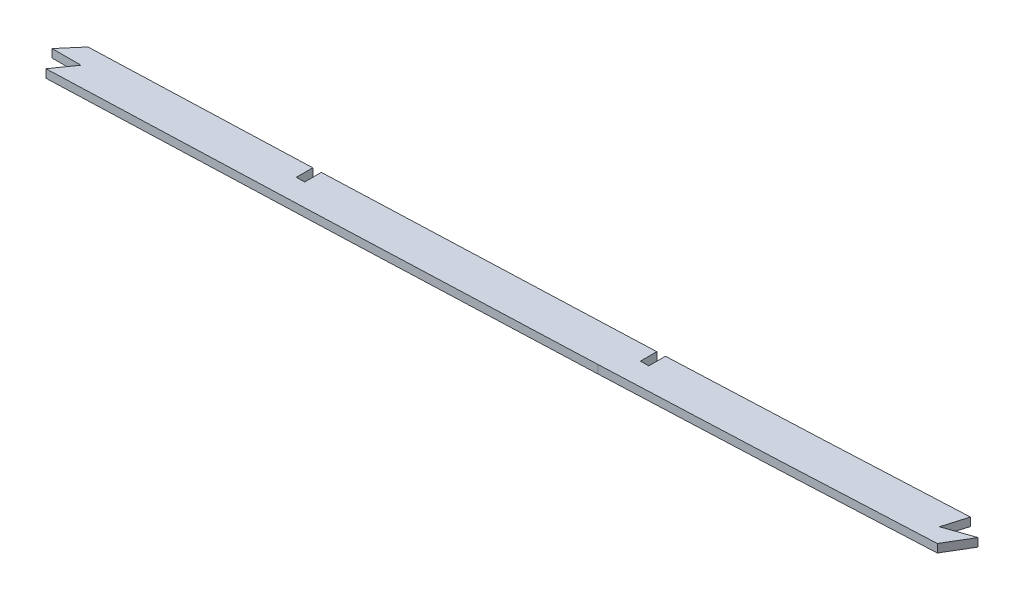
ISO-10303-21;
HEADER;
FILE_DESCRIPTION(('STEP AP214'),'2;1');
FILE_NAME('part.step','',(''),(''),'','','');
FILE_SCHEMA(('AUTOMOTIVE_DESIGN { 1 0 10303 214 1 1 1 1 }'));
ENDSEC;
DATA;
#1=APPLICATION_CONTEXT('core data for automotive mechanical design processes');
#2=APPLICATION_PROTOCOL_DEFINITION('international standard','automotive_design',2000,#1);
#3=PRODUCT_CONTEXT('',#1,'mechanical');
#4=PRODUCT('Part','Part','',(#3));
#5=PRODUCT_RELATED_PRODUCT_CATEGORY('part','',(#4));
#6=PRODUCT_DEFINITION_FORMATION('','',#4);
#7=PRODUCT_DEFINITION_CONTEXT('part definition',#1,'design');
#8=PRODUCT_DEFINITION('design','',#6,#7);
#9=PRODUCT_DEFINITION_SHAPE('','',#8);
#10=(LENGTH_UNIT() NAMED_UNIT(*) SI_UNIT(.MILLI.,.METRE.));
#11=(NAMED_UNIT(*) PLANE_ANGLE_UNIT() SI_UNIT($,.RADIAN.));
#12=(NAMED_UNIT(*) SI_UNIT($,.STERADIAN.) SOLID_ANGLE_UNIT());
#13=UNCERTAINTY_MEASURE_WITH_UNIT(LENGTH_MEASURE(1.E-05),#10,'distance_accuracy_value','');
#14=(GEOMETRIC_REPRESENTATION_CONTEXT(3) GLOBAL_UNCERTAINTY_ASSIGNED_CONTEXT((#13)) GLOBAL_UNIT_ASSIGNED_CONTEXT((#10,
#11,#12)) REPRESENTATION_CONTEXT('',''));
#15=CARTESIAN_POINT('',(0.,0.,0.));
#16=DIRECTION('',(0.,0.,1.));
#17=DIRECTION('',(1.,0.,0.));
#18=AXIS2_PLACEMENT_3D('',#15,#16,#17);
#19=CARTESIAN_POINT('',(2124.37830308858,1.5875,79.252749052653));
#20=CARTESIAN_POINT('',(2148.39751193199,1.5875,78.2710874108631));
#21=CARTESIAN_POINT('',(2196.44142591429,1.5875,76.2202304627624));
#22=CARTESIAN_POINT('',(2256.43632671494,1.5875,73.3193029777612));
#23=CARTESIAN_POINT('',(2304.39682766951,1.5875,70.6868537158113));
#24=CARTESIAN_POINT('',(2340.34200336636,1.5875,68.5440440460852));
#25=CARTESIAN_POINT('',(2376.16909953384,1.5875,66.0999017724206));
#26=CARTESIAN_POINT('',(2423.79225447921,1.5875,62.148433446528));
#27=CARTESIAN_POINT('',(2483.11730251875,1.5875,55.6326510171635));
#28=CARTESIAN_POINT('',(2554.04445691108,1.5875,45.2265308139822));
#29=CARTESIAN_POINT('',(2611.9061277636,1.5875,34.9727556057638));
#30=CARTESIAN_POINT('',(2648.22954061154,1.5875,27.8453657370829));
#31=CARTESIAN_POINT('',(2665.29052708524,1.5875,24.3690973591681));
#32=CARTESIAN_POINT('',(2678.0413738897,1.5875,21.7219433950603));
#33=CARTESIAN_POINT('',(2688.64049273064,1.5875,19.4481755033962));
#34=CARTESIAN_POINT('',(2694.99840626553,1.5875,18.0547973486536));
#35=B_SPLINE_CURVE_WITH_KNOTS('',3,(#19,#20,#21,#22,#23,#24,#25,#26,#27,#28,#29,#30,#31,#32,#33,
#34),.UNSPECIFIED.,.F.,.F.,(4,1,1,1,1,1,1,1,1,1,1,1,1,4),(0.,0.125,0.25,0.3125,0.375,0.4375,0.5,
0.625,0.75,0.875,0.931953524477232,0.943294603731027,0.965976762238616,1.),.UNSPECIFIED.);
#36=DIRECTION('',(0.,-1.,0.));
#37=VECTOR('',#36,1.);
#38=SURFACE_OF_LINEAR_EXTRUSION('',#35,#37);
#39=DIRECTION('',(0.,1.,0.));
#40=VECTOR('',#39,1.);
#41=CARTESIAN_POINT('',(2132.0125,-1.59253086897977,78.9392416373911));
#42=LINE('',#41,#40);
#43=CARTESIAN_POINT('',(2132.01250082935,-1.58999549922679,78.9392214921763));
#44=VERTEX_POINT('',#43);
#45=CARTESIAN_POINT('',(2132.0125,1.5875,78.9392416373911));
#46=VERTEX_POINT('',#45);
#47=EDGE_CURVE('E518',#44,#46,#42,.T.);
#48=ORIENTED_EDGE('',*,*,#47,.F.);
#49=CARTESIAN_POINT('',(2132.01250328962,-1.5875,78.9392415016407));
#50=CARTESIAN_POINT('',(2129.46775073384,-1.5875,79.0442540621415));
#51=CARTESIAN_POINT('',(2126.92301148821,-1.5875,79.1487471830766));
#52=CARTESIAN_POINT('',(2124.37830308858,-1.5875,79.252749052653));
#53=B_SPLINE_CURVE_WITH_KNOTS('',3,(#49,#50,#51,#52),.UNSPECIFIED.,.F.,.F.,(4,4),(0.,
0.013243090229482),.UNSPECIFIED.);
#54=CARTESIAN_POINT('',(2124.37829951673,-1.5875,79.2527491986346));
#55=VERTEX_POINT('',#54);
#56=EDGE_CURVE('E208',#55,#44,#53,.F.);
#57=ORIENTED_EDGE('',*,*,#56,.F.);
#58=DIRECTION('',(0.,-1.,0.));
#59=VECTOR('',#58,1.);
#60=CARTESIAN_POINT('',(2124.37829951673,1.5875,79.2527491986346));
#61=LINE('',#60,#59);
#62=CARTESIAN_POINT('',(2124.37829951673,1.5875,79.2527491986346));
#63=VERTEX_POINT('',#62);
#64=EDGE_CURVE('E346',#63,#55,#61,.T.);
#65=ORIENTED_EDGE('',*,*,#64,.F.);
#66=EDGE_CURVE('E263',#63,#46,#35,.T.);
#67=ORIENTED_EDGE('',*,*,#66,.T.);
#68=EDGE_LOOP('',(#48,#57,#65,#67));
#69=FACE_BOUND('',#68,.T.);
#70=ADVANCED_FACE('F40',(#69),#38,.T.);
#71=DIRECTION('',(0.,1.,0.));
#72=VECTOR('',#71,1.);
#73=CARTESIAN_POINT('',(2247.00294082068,-6.0325,73.7374416090095));
#74=LINE('',#73,#72);
#75=CARTESIAN_POINT('',(2247.00297100051,-1.5875,73.7373388385588));
#76=VERTEX_POINT('',#75);
#77=CARTESIAN_POINT('',(2247.00294082068,1.5875,73.7374416090095));
#78=VERTEX_POINT('',#77);
#79=EDGE_CURVE('E442',#76,#78,#74,.T.);
#80=ORIENTED_EDGE('',*,*,#79,.F.);
#81=CARTESIAN_POINT('',(2247.00301133067,-1.5875,73.7374380659046));
#82=CARTESIAN_POINT('',(2230.15102476226,-1.5875,74.5842451376354));
#83=CARTESIAN_POINT('',(2192.89202498818,-1.5875,76.3543836377749));
#84=CARTESIAN_POINT('',(2155.60411139383,-1.5875,77.9619285937053));
#85=CARTESIAN_POINT('',(2135.18750628123,-1.5875,78.8079495020118));
#86=B_SPLINE_CURVE_WITH_KNOTS('',3,(#81,#82,#83,#84,#85),.UNSPECIFIED.,.F.,.F.,(4,1,4),
(0.0187507346096735,0.106546377678717,0.212795643069043),.UNSPECIFIED.);
#87=CARTESIAN_POINT('',(2135.18750159821,-1.58997749916663,78.8079111511797));
#88=VERTEX_POINT('',#87);
#89=EDGE_CURVE('E215',#88,#76,#86,.F.);
#90=ORIENTED_EDGE('',*,*,#89,.F.);
#91=DIRECTION('',(0.,1.,0.));
#92=VECTOR('',#91,1.);
#93=CARTESIAN_POINT('',(2135.18750000957,-1.59253086897977,78.8079497618963));
#94=LINE('',#93,#92);
#95=CARTESIAN_POINT('',(2135.18750000957,1.5875,78.8079497618963));
#96=VERTEX_POINT('',#95);
#97=EDGE_CURVE('E494',#88,#96,#94,.T.);
#98=ORIENTED_EDGE('',*,*,#97,.T.);
#99=EDGE_CURVE('E200',#96,#78,#35,.T.);
#100=ORIENTED_EDGE('',*,*,#99,.T.);
#101=EDGE_LOOP('',(#80,#90,#98,#100));
#102=FACE_BOUND('',#101,.T.);
#103=ADVANCED_FACE('F493',(#102),#38,.T.);
#104=CARTESIAN_POINT('',(616.337750913255,1.5875,99.0566103609531));
#105=CARTESIAN_POINT('',(647.76049660052,1.5875,99.0799542657679));
#106=CARTESIAN_POINT('',(694.87068034325,1.5875,98.960929783245));
#107=CARTESIAN_POINT('',(757.779786958647,1.5875,98.8040630386954));
#108=CARTESIAN_POINT('',(820.69045818609,1.5875,98.7653484328497));
#109=CARTESIAN_POINT('',(899.289299877085,1.5875,98.7967965825531));
#110=CARTESIAN_POINT('',(993.586772551322,1.5875,98.8129149281116));
#111=CARTESIAN_POINT('',(1087.93191592796,1.5875,98.7323574871025));
#112=CARTESIAN_POINT('',(1182.33953079348,1.5875,99.1244994990799));
#113=CARTESIAN_POINT('',(1276.65398068122,1.5875,99.8147611994573));
#114=CARTESIAN_POINT('',(1370.85083148495,1.5875,100.131815232071));
#115=CARTESIAN_POINT('',(1464.98207813977,1.5875,99.4108190462021));
#116=CARTESIAN_POINT('',(1590.54945268054,1.5875,97.1511702631117));
#117=CARTESIAN_POINT('',(1747.54008126415,1.5875,92.7833872927443));
#118=CARTESIAN_POINT('',(1904.58058478476,1.5875,87.4795525069474));
#119=CARTESIAN_POINT('',(2030.20455421821,1.5875,82.9558758992198));
#120=CARTESIAN_POINT('',(2092.98705848864,1.5875,80.5357121207426));
#121=CARTESIAN_POINT('',(2124.37829951673,1.5875,79.2527491986346));
#122=B_SPLINE_CURVE_WITH_KNOTS('',3,(#104,#105,#106,#107,#108,#109,#110,#111,#112,#113,#114,
#115,#116,#117,#118,#119,#120,#121),.UNSPECIFIED.,.F.,.F.,(4,1,1,1,1,1,1,1,1,1,1,1,1,1,1,4),(0.,
0.0625,0.09375,0.125,0.1875,0.25,0.3125,0.375,0.4375,0.5,0.5625,0.625,0.75,0.875,0.9375,1.),.UNSPECIFIED.);
#123=DIRECTION('',(0.,-1.,0.));
#124=VECTOR('',#123,1.);
#125=SURFACE_OF_LINEAR_EXTRUSION('',#122,#124);
#126=DIRECTION('',(0.,1.,0.));
#127=VECTOR('',#126,1.);
#128=CARTESIAN_POINT('',(1921.82414159405,-6.0325,86.8230267836531));
#129=LINE('',#128,#127);
#130=CARTESIAN_POINT('',(1921.82416586264,-1.5875,86.822998441138));
#131=VERTEX_POINT('',#130);
#132=CARTESIAN_POINT('',(1921.82414159405,1.5875,86.8230267836531));
#133=VERTEX_POINT('',#132);
#134=EDGE_CURVE('E418',#131,#133,#129,.T.);
#135=ORIENTED_EDGE('',*,*,#134,.T.);
#136=CARTESIAN_POINT('',(2005.01249999027,1.5875,83.84691539418));
#137=VERTEX_POINT('',#136);
#138=EDGE_CURVE('E355',#133,#137,#122,.T.);
#139=ORIENTED_EDGE('',*,*,#138,.T.);
#140=DIRECTION('',(0.,1.,0.));
#141=VECTOR('',#140,1.);
#142=CARTESIAN_POINT('',(2005.01249999027,-1.59253086897977,83.84691539418));
#143=LINE('',#142,#141);
#144=CARTESIAN_POINT('',(2005.01249998173,-1.58970324848349,83.8465741901181));
#145=VERTEX_POINT('',#144);
#146=EDGE_CURVE('E234',#145,#137,#143,.T.);
#147=ORIENTED_EDGE('',*,*,#146,.F.);
#148=CARTESIAN_POINT('',(2005.01252218668,-1.5875,83.846914580959));
#149=CARTESIAN_POINT('',(1982.00576485537,-1.5875,84.6898247845221));
#150=CARTESIAN_POINT('',(1954.27553891633,-1.5875,85.6828548780801));
#151=CARTESIAN_POINT('',(1926.54476508251,-1.5875,86.657654555315));
#152=CARTESIAN_POINT('',(1921.82419205508,-1.5875,86.8230250159094));
#153=B_SPLINE_CURVE_WITH_KNOTS('',3,(#148,#149,#150,#151,#152),.UNSPECIFIED.,.F.,.F.,(4,1,4),
(0.865606010358815,0.911396672514716,0.9207906621559),.UNSPECIFIED.);
#154=EDGE_CURVE('E197',#131,#145,#153,.F.);
#155=ORIENTED_EDGE('',*,*,#154,.F.);
#156=EDGE_LOOP('',(#135,#139,#147,#155));
#157=FACE_BOUND('',#156,.T.);
#158=ADVANCED_FACE('F517',(#157),#125,.T.);
#159=CARTESIAN_POINT('',(616.326429146063,1.5875,114.296606155493));
#160=CARTESIAN_POINT('',(632.046217380175,1.5875,114.30828435968));
#161=CARTESIAN_POINT('',(647.765968153244,1.5875,114.29677439422));
#162=CARTESIAN_POINT('',(679.205420392794,1.5875,114.24323397025));
#163=CARTESIAN_POINT('',(694.925123066751,1.5875,114.201950932506));
#164=CARTESIAN_POINT('',(726.364532124698,1.5875,114.121681346548));
#165=CARTESIAN_POINT('',(742.084243399862,1.5875,114.083543006226));
#166=CARTESIAN_POINT('',(773.523671882744,1.5875,114.034083388907));
#167=CARTESIAN_POINT('',(789.243390213417,1.5875,114.023396075664));
#168=CARTESIAN_POINT('',(820.682831324826,1.5875,114.017303041489));
#169=CARTESIAN_POINT('',(836.402553623007,1.5875,114.020240225192));
#170=CARTESIAN_POINT('',(867.841997842806,1.5875,114.024821457385));
#171=CARTESIAN_POINT('',(883.561720421664,1.5875,114.028722489467));
#172=CARTESIAN_POINT('',(915.001165910892,1.5875,114.037662965197));
#173=CARTESIAN_POINT('',(930.720888644625,1.5875,114.042095840025));
#174=CARTESIAN_POINT('',(962.160332217753,1.5875,114.044456392842));
#175=CARTESIAN_POINT('',(977.880053630737,1.5875,114.042025852399));
#176=CARTESIAN_POINT('',(1025.03924062521,1.5875,114.02635266127));
#177=CARTESIAN_POINT('',(1056.47872633141,1.5875,114.001081239981));
#178=CARTESIAN_POINT('',(1103.63774370583,1.5875,114.076141518065));
#179=CARTESIAN_POINT('',(1119.35738201238,1.5875,114.119430036675));
#180=CARTESIAN_POINT('',(1150.79658971577,1.5875,114.242868384306));
#181=CARTESIAN_POINT('',(1166.51615941665,1.5875,114.322855573181));
#182=CARTESIAN_POINT('',(1213.67480633689,1.5875,114.596079866728));
#183=CARTESIAN_POINT('',(1245.11381381393,1.5875,114.824335417931));
#184=CARTESIAN_POINT('',(1307.99206873737,1.5875,115.160349224997));
#185=CARTESIAN_POINT('',(1339.43132783757,1.5875,115.262775920084));
#186=CARTESIAN_POINT('',(1386.59071758969,1.5875,115.166774968219));
#187=CARTESIAN_POINT('',(1402.31059775436,1.5875,115.09313610926));
#188=CARTESIAN_POINT('',(1433.75053971329,1.5875,114.855373393272));
#189=CARTESIAN_POINT('',(1449.46971812607,1.5875,114.691491377402));
#190=CARTESIAN_POINT('',(1480.90524720166,1.5875,114.282993412757));
#191=CARTESIAN_POINT('',(1496.62184273389,1.5875,114.038617844409));
#192=CARTESIAN_POINT('',(1528.05323424889,1.5875,113.488096449305));
#193=CARTESIAN_POINT('',(1543.76803918056,1.5875,113.182257797232));
#194=CARTESIAN_POINT('',(1590.91012672281,1.5875,112.184857954141));
#195=CARTESIAN_POINT('',(1622.33508716355,1.5875,111.413587350345));
#196=CARTESIAN_POINT('',(1685.18062244756,1.5875,109.720508746898));
#197=CARTESIAN_POINT('',(1716.60120600918,1.5875,108.799000007991));
#198=CARTESIAN_POINT('',(1779.43954296825,1.5875,106.858836007746));
#199=CARTESIAN_POINT('',(1810.85730451947,1.5875,105.840460627799));
#200=CARTESIAN_POINT('',(1873.69102784609,1.5875,103.741931839349));
#201=CARTESIAN_POINT('',(1905.10699770462,1.5875,102.662055887814));
#202=CARTESIAN_POINT('',(1967.93740090808,1.5875,100.449562537391));
#203=CARTESIAN_POINT('',(1999.35184226252,1.5875,99.3172200683351));
#204=CARTESIAN_POINT('',(2062.17844269824,1.5875,96.9741951872324));
#205=CARTESIAN_POINT('',(2093.59060920955,1.5875,95.7637678134024));
#206=CARTESIAN_POINT('',(2125.00064017427,1.5875,94.4800369448474));
#207=B_SPLINE_CURVE_WITH_KNOTS('',3,(#159,#160,#161,#162,#163,#164,#165,#166,#167,#168,#169,
#170,#171,#172,#173,#174,#175,#176,#177,#178,#179,#180,#181,#182,#183,#184,#185,#186,#187,#188,
#189,#190,#191,#192,#193,#194,#195,#196,#197,#198,#199,#200,#201,#202,#203,#204,#205,#206),
.UNSPECIFIED.,.F.,.F.,(4,2,2,2,2,2,2,2,2,2,2,2,2,2,2,2,2,2,2,2,2,2,2,4),(0.,0.0312499999999999,
0.0624999999999998,0.0937499999999997,0.125,0.156249999999999,0.187499999999999,
0.218749999999999,0.249999999999999,0.312499999999999,0.343749999999999,0.374999999999999,
0.437499999999998,0.499999999999998,0.531249999999998,0.562499999999998,0.593749999999999,
0.624999999999999,0.687499999999999,0.749999999999999,0.812499999999999,0.875,0.9375,1.),.UNSPECIFIED.);
#208=DIRECTION('',(0.,-1.,0.));
#209=VECTOR('',#208,1.);
#210=SURFACE_OF_LINEAR_EXTRUSION('',#207,#209);
#211=CARTESIAN_POINT('',(2125.00064017427,1.5875,94.4800369448474));
#212=CARTESIAN_POINT('',(2093.59060920955,1.5875,95.7637678134024));
#213=CARTESIAN_POINT('',(2062.17844269824,1.5875,96.9741951872324));
#214=CARTESIAN_POINT('',(1999.35184226252,1.5875,99.3172200683351));
#215=CARTESIAN_POINT('',(1967.93740090808,1.5875,100.449562537391));
#216=CARTESIAN_POINT('',(1931.3515538202,1.5875,101.737886967515));
#217=CARTESIAN_POINT('',(1926.18088752193,1.5875,101.919250338178));
#218=CARTESIAN_POINT('',(1921.01019986067,1.5875,102.099880415705));
#219=B_SPLINE_CURVE_WITH_KNOTS('',3,(#211,#212,#213,#214,#215,#216,#217,#218),.UNSPECIFIED.,.F.,
.F.,(4,2,2,4),(0.864713090274523,0.927213090274523,0.989713090274523,1.),.UNSPECIFIED.);
#220=CARTESIAN_POINT('',(1921.01019968797,1.5875,102.099880421738));
#221=VERTEX_POINT('',#220);
#222=CARTESIAN_POINT('',(2125.00064017427,1.5875,94.4800369448474));
#223=VERTEX_POINT('',#222);
#224=EDGE_CURVE('E185',#221,#223,#219,.F.);
#225=ORIENTED_EDGE('',*,*,#224,.F.);
#226=DIRECTION('',(0.,1.,0.));
#227=VECTOR('',#226,1.);
#228=CARTESIAN_POINT('',(1921.01019968797,-6.0325,102.099880421738));
#229=LINE('',#228,#227);
#230=CARTESIAN_POINT('',(1921.01019968797,-1.5875,102.099880421738));
#231=VERTEX_POINT('',#230);
#232=EDGE_CURVE('E169',#231,#221,#229,.T.);
#233=ORIENTED_EDGE('',*,*,#232,.F.);
#234=CARTESIAN_POINT('',(1921.01019985471,-1.5875,102.099880415913));
#235=CARTESIAN_POINT('',(1926.18088751795,-1.5875,101.919250338317));
#236=CARTESIAN_POINT('',(1931.35155381821,-1.5875,101.737886967585));
#237=CARTESIAN_POINT('',(1967.93740090808,-1.5875,100.449562537391));
#238=CARTESIAN_POINT('',(1999.35184226252,-1.5875,99.3172200683351));
#239=CARTESIAN_POINT('',(2062.17844269824,-1.5875,96.9741951872324));
#240=CARTESIAN_POINT('',(2093.59060920955,-1.5875,95.7637678134024));
#241=CARTESIAN_POINT('',(2125.00064017427,-1.5875,94.4800369448474));
#242=B_SPLINE_CURVE_WITH_KNOTS('',3,(#234,#235,#236,#237,#238,#239,#240,#241),.UNSPECIFIED.,.F.,
.F.,(4,2,2,4),(0.86471309027057,0.875,0.9375,1.),.UNSPECIFIED.);
#243=CARTESIAN_POINT('',(2125.00064017427,-1.5875,94.4800369448474));
#244=VERTEX_POINT('',#243);
#245=EDGE_CURVE('E228',#231,#244,#242,.T.);
#246=ORIENTED_EDGE('',*,*,#245,.T.);
#247=DIRECTION('',(0.,-1.,0.));
#248=VECTOR('',#247,1.);
#249=CARTESIAN_POINT('',(2125.00064017427,1.5875,94.4800369448474));
#250=LINE('',#249,#248);
#251=EDGE_CURVE('E193',#223,#244,#250,.T.);
#252=ORIENTED_EDGE('',*,*,#251,.F.);
#253=EDGE_LOOP('',(#225,#233,#246,#252));
#254=FACE_BOUND('',#253,.T.);
#255=ADVANCED_FACE('F42',(#254),#210,.F.);
#256=CARTESIAN_POINT('',(2125.00064017427,1.5875,94.4800369448474));
#257=CARTESIAN_POINT('',(2149.04351205278,1.5875,93.497408198186));
#258=CARTESIAN_POINT('',(2173.08465693507,1.5875,92.4714303186568));
#259=CARTESIAN_POINT('',(2221.16051111618,1.5875,90.2825451342161));
#260=CARTESIAN_POINT('',(2245.19553408109,1.5875,89.1196551679897));
#261=CARTESIAN_POINT('',(2281.23975724731,1.5875,87.2213575710183));
#262=CARTESIAN_POINT('',(2293.25302693238,1.5875,86.5622387735997));
#263=CARTESIAN_POINT('',(2317.27629287288,1.5875,85.1853725215189));
#264=CARTESIAN_POINT('',(2329.28667496271,1.5875,84.4695877060572));
#265=CARTESIAN_POINT('',(2353.30043194924,1.5875,82.9360976908141));
#266=CARTESIAN_POINT('',(2365.30329886088,1.5875,82.1167454790412));
#267=CARTESIAN_POINT('',(2389.29570022096,1.5875,80.3032013832875));
#268=CARTESIAN_POINT('',(2401.28513168761,1.5875,79.3076590137664));
#269=CARTESIAN_POINT('',(2425.248015539,1.5875,77.1070272915958));
#270=CARTESIAN_POINT('',(2437.21939504412,1.5875,75.9021262287262));
#271=CARTESIAN_POINT('',(2461.1350429249,1.5875,73.2728607205226));
#272=CARTESIAN_POINT('',(2473.08021873022,1.5875,71.848649743833));
#273=CARTESIAN_POINT('',(2496.94588972892,1.5875,68.7864051538839));
#274=CARTESIAN_POINT('',(2508.86721006671,1.5875,67.1484398221377));
#275=CARTESIAN_POINT('',(2532.67675150176,1.5875,63.6755945009625));
#276=CARTESIAN_POINT('',(2544.56619473404,1.5875,61.8407677680709));
#277=CARTESIAN_POINT('',(2568.31735906903,1.5875,57.9931353056948));
#278=CARTESIAN_POINT('',(2580.17961126629,1.5875,55.980432346589));
#279=CARTESIAN_POINT('',(2603.8765766664,1.5875,51.794563265322));
#280=CARTESIAN_POINT('',(2615.71090980775,1.5875,49.6216949956207));
#281=CARTESIAN_POINT('',(2639.35036015543,1.5875,45.1250865007013));
#282=CARTESIAN_POINT('',(2651.15621950326,1.5875,42.8015133301686));
#283=CARTESIAN_POINT('',(2674.73471693345,1.5875,37.9973454558139));
#284=CARTESIAN_POINT('',(2686.50776170266,1.5875,35.5172707099935));
#285=CARTESIAN_POINT('',(2698.26092171884,1.5875,32.9414891543206));
#286=B_SPLINE_CURVE_WITH_KNOTS('',3,(#256,#257,#258,#259,#260,#261,#262,#263,#264,#265,#266,
#267,#268,#269,#270,#271,#272,#273,#274,#275,#276,#277,#278,#279,#280,#281,#282,#283,#284,#285),
.UNSPECIFIED.,.F.,.F.,(4,2,2,2,2,2,2,2,2,2,2,2,2,2,4),(0.,0.125,0.25,0.3125,0.375,0.4375,0.5,
0.5625,0.625,0.6875,0.75,0.8125,0.875,0.9375,1.),.UNSPECIFIED.);
#287=DIRECTION('',(0.,-1.,0.));
#288=VECTOR('',#287,1.);
#289=SURFACE_OF_LINEAR_EXTRUSION('',#286,#288);
#290=CARTESIAN_POINT('',(2125.00064017427,-1.5875,94.4800369448474));
#291=CARTESIAN_POINT('',(2149.04351205278,-1.5875,93.497408198186));
#292=CARTESIAN_POINT('',(2173.08465693507,-1.5875,92.4714303186568));
#293=CARTESIAN_POINT('',(2214.56442002988,-1.5875,90.5828640011387));
#294=CARTESIAN_POINT('',(2232.00472704018,-1.5875,89.7527033976876));
#295=CARTESIAN_POINT('',(2249.44249777476,-1.5875,88.8734429911872));
#296=B_SPLINE_CURVE_WITH_KNOTS('',3,(#290,#291,#292,#293,#294,#295),.UNSPECIFIED.,.F.,.F.,(4,2,
4),(0.,0.125,0.215699563748549),.UNSPECIFIED.);
#297=CARTESIAN_POINT('',(2249.44247793253,-1.5875,88.873417306855));
#298=VERTEX_POINT('',#297);
#299=EDGE_CURVE('E221',#244,#298,#296,.T.);
#300=ORIENTED_EDGE('',*,*,#299,.T.);
#301=DIRECTION('',(0.,1.,0.));
#302=VECTOR('',#301,1.);
#303=CARTESIAN_POINT('',(2249.44246084476,-6.0325,88.8734462643836));
#304=LINE('',#303,#302);
#305=CARTESIAN_POINT('',(2249.44249526015,1.5875,88.873387947819));
#306=VERTEX_POINT('',#305);
#307=EDGE_CURVE('E190',#298,#306,#304,.T.);
#308=ORIENTED_EDGE('',*,*,#307,.T.);
#309=CARTESIAN_POINT('',(2249.44249803493,1.5875,88.8734429780689));
#310=CARTESIAN_POINT('',(2232.00472721365,1.5875,89.7527033894304));
#311=CARTESIAN_POINT('',(2214.56442011663,1.5875,90.5828639971894));
#312=CARTESIAN_POINT('',(2173.08465693507,1.5875,92.4714303186568));
#313=CARTESIAN_POINT('',(2149.04351205278,1.5875,93.497408198186));
#314=CARTESIAN_POINT('',(2125.00064017427,1.5875,94.4800369448474));
#315=B_SPLINE_CURVE_WITH_KNOTS('',3,(#309,#310,#311,#312,#313,#314),.UNSPECIFIED.,.F.,.F.,(4,2,
4),(0.,0.0906995641996166,0.215699564199617),.UNSPECIFIED.);
#316=EDGE_CURVE('E196',#223,#306,#315,.F.);
#317=ORIENTED_EDGE('',*,*,#316,.F.);
#318=ORIENTED_EDGE('',*,*,#251,.T.);
#319=EDGE_LOOP('',(#300,#308,#317,#318));
#320=FACE_BOUND('',#319,.T.);
#321=ADVANCED_FACE('F271',(#320),#289,.F.);
#322=DIRECTION('',(0.,1.,0.));
#323=VECTOR('',#322,1.);
#324=CARTESIAN_POINT('',(2008.1875,-1.59253086897977,83.7304698647795));
#325=LINE('',#324,#323);
#326=CARTESIAN_POINT('',(2008.18749998871,-1.58969008464704,83.7301124165398));
#327=VERTEX_POINT('',#326);
#328=CARTESIAN_POINT('',(2008.1875,1.5875,83.7304698647795));
#329=VERTEX_POINT('',#328);
#330=EDGE_CURVE('E238',#327,#329,#325,.T.);
#331=ORIENTED_EDGE('',*,*,#330,.T.);
#332=EDGE_CURVE('E476',#329,#63,#122,.T.);
#333=ORIENTED_EDGE('',*,*,#332,.T.);
#334=ORIENTED_EDGE('',*,*,#64,.T.);
#335=CARTESIAN_POINT('',(2124.37829951673,-1.5875,79.2527491986346));
#336=CARTESIAN_POINT('',(2092.98705848864,-1.5875,80.5357121207426));
#337=CARTESIAN_POINT('',(2054.26134870803,-1.5875,82.0285254641407));
#338=CARTESIAN_POINT('',(2015.52442247401,-1.5875,83.4611005637562));
#339=CARTESIAN_POINT('',(2008.1875231896,-1.5875,83.7304690133918));
#340=B_SPLINE_CURVE_WITH_KNOTS('',3,(#335,#336,#337,#338,#339),.UNSPECIFIED.,.F.,.F.,(4,1,4),
(0.922897090856314,0.985397090856314,1.),.UNSPECIFIED.);
#341=EDGE_CURVE('E201',#327,#55,#340,.F.);
#342=ORIENTED_EDGE('',*,*,#341,.F.);
#343=EDGE_LOOP('',(#331,#333,#334,#342));
#344=FACE_BOUND('',#343,.T.);
#345=ADVANCED_FACE('F275',(#344),#125,.T.);
#346=CARTESIAN_POINT('',(0.,1.5875,0.));
#347=DIRECTION('',(0.,1.,0.));
#348=DIRECTION('',(0.,0.,1.));
#349=AXIS2_PLACEMENT_3D('',#346,#347,#348);
#350=PLANE('',#349);
#351=DIRECTION('',(0.650401410500427,0.,-0.759590682683151));
#352=VECTOR('',#351,1.);
#353=CARTESIAN_POINT('',(1921.82414159405,1.5875,86.8230267836531));
#354=LINE('',#353,#352);
#355=CARTESIAN_POINT('',(1915.4903448002,1.5875,94.2201402476524));
#356=VERTEX_POINT('',#355);
#357=EDGE_CURVE('E179',#356,#133,#354,.T.);
#358=ORIENTED_EDGE('',*,*,#357,.F.);
#359=DIRECTION('',(-1.,0.,0.));
#360=VECTOR('',#359,1.);
#361=CARTESIAN_POINT('',(1915.4903448002,1.5875,94.2201402476524));
#362=LINE('',#361,#360);
#363=CARTESIAN_POINT('',(1926.53005457574,1.5875,94.2201402476524));
#364=VERTEX_POINT('',#363);
#365=EDGE_CURVE('E188',#364,#356,#362,.T.);
#366=ORIENTED_EDGE('',*,*,#365,.F.);
#367=DIRECTION('',(0.573743913776215,0.,-0.819034749815142));
#368=VECTOR('',#367,1.);
#369=CARTESIAN_POINT('',(1926.53005457574,1.5875,94.2201402476524));
#370=LINE('',#369,#368);
#371=EDGE_CURVE('E172',#221,#364,#370,.T.);
#372=ORIENTED_EDGE('',*,*,#371,.F.);
#373=ORIENTED_EDGE('',*,*,#224,.T.);
#374=ORIENTED_EDGE('',*,*,#316,.T.);
#375=DIRECTION('',(-0.512830577802956,0.,0.858489835973779));
#376=VECTOR('',#375,1.);
#377=CARTESIAN_POINT('',(2255.27963870823,1.5875,79.1018802083375));
#378=LINE('',#377,#376);
#379=CARTESIAN_POINT('',(2255.27963870823,1.5875,79.1018802083375));
#380=VERTEX_POINT('',#379);
#381=EDGE_CURVE('E436',#380,#306,#378,.T.);
#382=ORIENTED_EDGE('',*,*,#381,.F.);
#383=DIRECTION('',(0.944756611917633,0.,-0.327772702093868));
#384=VECTOR('',#383,1.);
#385=CARTESIAN_POINT('',(2244.31061590084,1.5875,82.9074595496765));
#386=LINE('',#385,#384);
#387=CARTESIAN_POINT('',(2244.31061590084,1.5875,82.9074595496765));
#388=VERTEX_POINT('',#387);
#389=EDGE_CURVE('E432',#388,#380,#386,.T.);
#390=ORIENTED_EDGE('',*,*,#389,.F.);
#391=DIRECTION('',(-0.281709891618831,0.,0.959499628433543));
#392=VECTOR('',#391,1.);
#393=CARTESIAN_POINT('',(2247.00294082068,1.5875,73.7374416090095));
#394=LINE('',#393,#392);
#395=EDGE_CURVE('E429',#78,#388,#394,.T.);
#396=ORIENTED_EDGE('',*,*,#395,.F.);
#397=ORIENTED_EDGE('',*,*,#99,.F.);
#398=DIRECTION('',(0.,0.,-1.));
#399=VECTOR('',#398,1.);
#400=CARTESIAN_POINT('',(2135.1875,1.5875,0.));
#401=LINE('',#400,#399);
#402=CARTESIAN_POINT('',(2135.1875,1.5875,85.2236637930603));
#403=VERTEX_POINT('',#402);
#404=EDGE_CURVE('E498',#403,#96,#401,.T.);
#405=ORIENTED_EDGE('',*,*,#404,.F.);
#406=DIRECTION('',(1.,0.,0.));
#407=VECTOR('',#406,1.);
#408=CARTESIAN_POINT('',(0.,1.5875,85.2236637930603));
#409=LINE('',#408,#407);
#410=CARTESIAN_POINT('',(2132.0125,1.5875,85.2236637930603));
#411=VERTEX_POINT('',#410);
#412=EDGE_CURVE('E543',#411,#403,#409,.T.);
#413=ORIENTED_EDGE('',*,*,#412,.F.);
#414=DIRECTION('',(0.,0.,1.));
#415=VECTOR('',#414,1.);
#416=CARTESIAN_POINT('',(2132.0125,1.5875,0.));
#417=LINE('',#416,#415);
#418=EDGE_CURVE('E422',#46,#411,#417,.T.);
#419=ORIENTED_EDGE('',*,*,#418,.F.);
#420=ORIENTED_EDGE('',*,*,#66,.F.);
#421=ORIENTED_EDGE('',*,*,#332,.F.);
#422=DIRECTION('',(0.,0.,-1.));
#423=VECTOR('',#422,1.);
#424=CARTESIAN_POINT('',(2008.18750000001,1.5875,1.39166535942303E-10));
#425=LINE('',#424,#423);
#426=CARTESIAN_POINT('',(2008.1875,1.5875,90.138723070676));
#427=VERTEX_POINT('',#426);
#428=EDGE_CURVE('E552',#427,#329,#425,.T.);
#429=ORIENTED_EDGE('',*,*,#428,.F.);
#430=DIRECTION('',(1.,0.,0.));
#431=VECTOR('',#430,1.);
#432=CARTESIAN_POINT('',(0.,1.5875,90.138723070676));
#433=LINE('',#432,#431);
#434=CARTESIAN_POINT('',(2005.0125,1.5875,90.138723070676));
#435=VERTEX_POINT('',#434);
#436=EDGE_CURVE('E527',#435,#427,#433,.T.);
#437=ORIENTED_EDGE('',*,*,#436,.F.);
#438=DIRECTION('',(0.,0.,1.));
#439=VECTOR('',#438,1.);
#440=CARTESIAN_POINT('',(2005.01249999999,1.5875,-1.4151806008634E-10));
#441=LINE('',#440,#439);
#442=EDGE_CURVE('E523',#137,#435,#441,.T.);
#443=ORIENTED_EDGE('',*,*,#442,.F.);
#444=ORIENTED_EDGE('',*,*,#138,.F.);
#445=EDGE_LOOP('',(#358,#366,#372,#373,#374,#382,#390,#396,#397,#405,#413,#419,#420,#421,#429,
#437,#443,#444));
#446=FACE_BOUND('',#445,.T.);
#447=ADVANCED_FACE('F183',(#446),#350,.T.);
#448=CARTESIAN_POINT('',(0.,-1.5875,0.));
#449=DIRECTION('',(0.,1.,0.));
#450=DIRECTION('',(0.,0.,1.));
#451=AXIS2_PLACEMENT_3D('',#448,#449,#450);
#452=PLANE('',#451);
#453=DIRECTION('',(-1.,0.,0.));
#454=VECTOR('',#453,1.);
#455=CARTESIAN_POINT('',(0.,-1.5875,94.2201402476524));
#456=LINE('',#455,#454);
#457=CARTESIAN_POINT('',(1926.53005457574,-1.5875,94.2201402476525));
#458=VERTEX_POINT('',#457);
#459=CARTESIAN_POINT('',(1915.4903448002,-1.5875,94.2201402476524));
#460=VERTEX_POINT('',#459);
#461=EDGE_CURVE('E53',#458,#460,#456,.T.);
#462=ORIENTED_EDGE('',*,*,#461,.T.);
#463=DIRECTION('',(0.650401410500427,0.,-0.759590682683151));
#464=VECTOR('',#463,1.);
#465=CARTESIAN_POINT('',(1151.74420802777,-1.5875,986.183841527493));
#466=LINE('',#465,#464);
#467=EDGE_CURVE('E11',#460,#131,#466,.T.);
#468=ORIENTED_EDGE('',*,*,#467,.T.);
#469=ORIENTED_EDGE('',*,*,#154,.T.);
#470=DIRECTION('',(0.,0.,1.));
#471=VECTOR('',#470,1.);
#472=CARTESIAN_POINT('',(2005.01249999999,-1.5875,-1.4151806008634E-10));
#473=LINE('',#472,#471);
#474=CARTESIAN_POINT('',(2005.0125,-1.5875,90.138723070676));
#475=VERTEX_POINT('',#474);
#476=EDGE_CURVE('E393',#145,#475,#473,.T.);
#477=ORIENTED_EDGE('',*,*,#476,.T.);
#478=DIRECTION('',(1.,0.,0.));
#479=VECTOR('',#478,1.);
#480=CARTESIAN_POINT('',(0.,-1.5875,90.138723070676));
#481=LINE('',#480,#479);
#482=CARTESIAN_POINT('',(2008.1875,-1.5875,90.138723070676));
#483=VERTEX_POINT('',#482);
#484=EDGE_CURVE('E571',#475,#483,#481,.T.);
#485=ORIENTED_EDGE('',*,*,#484,.T.);
#486=DIRECTION('',(0.,0.,-1.));
#487=VECTOR('',#486,1.);
#488=CARTESIAN_POINT('',(2008.18750000001,-1.5875,1.39166535942303E-10));
#489=LINE('',#488,#487);
#490=EDGE_CURVE('E577',#483,#327,#489,.T.);
#491=ORIENTED_EDGE('',*,*,#490,.T.);
#492=ORIENTED_EDGE('',*,*,#341,.T.);
#493=ORIENTED_EDGE('',*,*,#56,.T.);
#494=DIRECTION('',(0.,0.,1.));
#495=VECTOR('',#494,1.);
#496=CARTESIAN_POINT('',(2132.0125,-1.5875,0.));
#497=LINE('',#496,#495);
#498=CARTESIAN_POINT('',(2132.0125,-1.5875,85.2236637930603));
#499=VERTEX_POINT('',#498);
#500=EDGE_CURVE('E567',#44,#499,#497,.T.);
#501=ORIENTED_EDGE('',*,*,#500,.T.);
#502=DIRECTION('',(1.,0.,0.));
#503=VECTOR('',#502,1.);
#504=CARTESIAN_POINT('',(0.,-1.5875,85.2236637930603));
#505=LINE('',#504,#503);
#506=CARTESIAN_POINT('',(2135.1875,-1.5875,85.2236637930603));
#507=VERTEX_POINT('',#506);
#508=EDGE_CURVE('E341',#499,#507,#505,.T.);
#509=ORIENTED_EDGE('',*,*,#508,.T.);
#510=DIRECTION('',(0.,0.,-1.));
#511=VECTOR('',#510,1.);
#512=CARTESIAN_POINT('',(2135.1875,-1.5875,0.));
#513=LINE('',#512,#511);
#514=EDGE_CURVE('E572',#507,#88,#513,.T.);
#515=ORIENTED_EDGE('',*,*,#514,.T.);
#516=ORIENTED_EDGE('',*,*,#89,.T.);
#517=DIRECTION('',(-0.281709891618831,0.,0.959499628433543));
#518=VECTOR('',#517,1.);
#519=CARTESIAN_POINT('',(2088.61101700897,-1.5875,613.217937557803));
#520=LINE('',#519,#518);
#521=CARTESIAN_POINT('',(2244.31061590084,-1.5875,82.9074595496766));
#522=VERTEX_POINT('',#521);
#523=EDGE_CURVE('E389',#76,#522,#520,.T.);
#524=ORIENTED_EDGE('',*,*,#523,.T.);
#525=DIRECTION('',(0.944756611917633,0.,-0.327772702093868));
#526=VECTOR('',#525,1.);
#527=CARTESIAN_POINT('',(266.790959777028,-1.5875,768.985707592622));
#528=LINE('',#527,#526);
#529=CARTESIAN_POINT('',(2255.27963870823,-1.5875,79.1018802083375));
#530=VERTEX_POINT('',#529);
#531=EDGE_CURVE('E392',#522,#530,#528,.T.);
#532=ORIENTED_EDGE('',*,*,#531,.T.);
#533=DIRECTION('',(-0.512830577802956,0.,0.858489835973779));
#534=VECTOR('',#533,1.);
#535=CARTESIAN_POINT('',(1696.97729663539,-1.5875,1013.71246470833));
#536=LINE('',#535,#534);
#537=EDGE_CURVE('E399',#530,#298,#536,.T.);
#538=ORIENTED_EDGE('',*,*,#537,.T.);
#539=ORIENTED_EDGE('',*,*,#299,.F.);
#540=ORIENTED_EDGE('',*,*,#245,.F.);
#541=DIRECTION('',(0.573743913776215,0.,-0.819034749815142));
#542=VECTOR('',#541,1.);
#543=CARTESIAN_POINT('',(1336.62645727406,-1.5875,936.323269588185));
#544=LINE('',#543,#542);
#545=EDGE_CURVE('E175',#231,#458,#544,.T.);
#546=ORIENTED_EDGE('',*,*,#545,.T.);
#547=EDGE_LOOP('',(#462,#468,#469,#477,#485,#491,#492,#493,#501,#509,#515,#516,#524,#532,#538,
#539,#540,#546));
#548=FACE_BOUND('',#547,.T.);
#549=ADVANCED_FACE('F303',(#548),#452,.F.);
#550=CARTESIAN_POINT('',(2132.0125,-1.59253086897977,0.));
#551=DIRECTION('',(-1.,0.,0.));
#552=DIRECTION('',(0.,0.,1.));
#553=AXIS2_PLACEMENT_3D('',#550,#551,#552);
#554=PLANE('',#553);
#555=ORIENTED_EDGE('',*,*,#47,.T.);
#556=ORIENTED_EDGE('',*,*,#418,.T.);
#557=DIRECTION('',(0.,1.,0.));
#558=VECTOR('',#557,1.);
#559=CARTESIAN_POINT('',(2132.0125,-1.59253086897977,85.2236637930603));
#560=LINE('',#559,#558);
#561=EDGE_CURVE('E536',#499,#411,#560,.T.);
#562=ORIENTED_EDGE('',*,*,#561,.F.);
#563=ORIENTED_EDGE('',*,*,#500,.F.);
#564=EDGE_LOOP('',(#555,#556,#562,#563));
#565=FACE_BOUND('',#564,.T.);
#566=ADVANCED_FACE('F311',(#565),#554,.F.);
#567=CARTESIAN_POINT('',(2135.1875,-1.59253086897977,0.));
#568=DIRECTION('',(1.,0.,0.));
#569=DIRECTION('',(0.,0.,-1.));
#570=AXIS2_PLACEMENT_3D('',#567,#568,#569);
#571=PLANE('',#570);
#572=DIRECTION('',(0.,1.,0.));
#573=VECTOR('',#572,1.);
#574=CARTESIAN_POINT('',(2135.1875,-1.59253086897977,85.2236637930603));
#575=LINE('',#574,#573);
#576=EDGE_CURVE('E529',#507,#403,#575,.T.);
#577=ORIENTED_EDGE('',*,*,#576,.T.);
#578=ORIENTED_EDGE('',*,*,#404,.T.);
#579=ORIENTED_EDGE('',*,*,#97,.F.);
#580=ORIENTED_EDGE('',*,*,#514,.F.);
#581=EDGE_LOOP('',(#577,#578,#579,#580));
#582=FACE_BOUND('',#581,.T.);
#583=ADVANCED_FACE('F671',(#582),#571,.F.);
#584=CARTESIAN_POINT('',(0.,-1.59253086897977,85.2236637930603));
#585=DIRECTION('',(0.,0.,1.));
#586=DIRECTION('',(1.,0.,0.));
#587=AXIS2_PLACEMENT_3D('',#584,#585,#586);
#588=PLANE('',#587);
#589=ORIENTED_EDGE('',*,*,#561,.T.);
#590=ORIENTED_EDGE('',*,*,#412,.T.);
#591=ORIENTED_EDGE('',*,*,#576,.F.);
#592=ORIENTED_EDGE('',*,*,#508,.F.);
#593=EDGE_LOOP('',(#589,#590,#591,#592));
#594=FACE_BOUND('',#593,.T.);
#595=ADVANCED_FACE('F664',(#594),#588,.F.);
#596=CARTESIAN_POINT('',(2005.01249999999,-1.59253086897977,-1.4151806008634E-10));
#597=DIRECTION('',(-1.,0.,0.));
#598=DIRECTION('',(0.,0.,1.));
#599=AXIS2_PLACEMENT_3D('',#596,#597,#598);
#600=PLANE('',#599);
#601=ORIENTED_EDGE('',*,*,#146,.T.);
#602=ORIENTED_EDGE('',*,*,#442,.T.);
#603=DIRECTION('',(0.,1.,0.));
#604=VECTOR('',#603,1.);
#605=CARTESIAN_POINT('',(2005.0125,-1.59253086897977,90.138723070676));
#606=LINE('',#605,#604);
#607=EDGE_CURVE('E549',#475,#435,#606,.T.);
#608=ORIENTED_EDGE('',*,*,#607,.F.);
#609=ORIENTED_EDGE('',*,*,#476,.F.);
#610=EDGE_LOOP('',(#601,#602,#608,#609));
#611=FACE_BOUND('',#610,.T.);
#612=ADVANCED_FACE('F588',(#611),#600,.F.);
#613=CARTESIAN_POINT('',(2008.18750000001,-1.59253086897977,1.39166535942303E-10));
#614=DIRECTION('',(1.,0.,0.));
#615=DIRECTION('',(0.,0.,-1.));
#616=AXIS2_PLACEMENT_3D('',#613,#614,#615);
#617=PLANE('',#616);
#618=DIRECTION('',(0.,1.,0.));
#619=VECTOR('',#618,1.);
#620=CARTESIAN_POINT('',(2008.1875,-1.59253086897977,90.138723070676));
#621=LINE('',#620,#619);
#622=EDGE_CURVE('E246',#483,#427,#621,.T.);
#623=ORIENTED_EDGE('',*,*,#622,.T.);
#624=ORIENTED_EDGE('',*,*,#428,.T.);
#625=ORIENTED_EDGE('',*,*,#330,.F.);
#626=ORIENTED_EDGE('',*,*,#490,.F.);
#627=EDGE_LOOP('',(#623,#624,#625,#626));
#628=FACE_BOUND('',#627,.T.);
#629=ADVANCED_FACE('F565',(#628),#617,.F.);
#630=CARTESIAN_POINT('',(0.,-1.59253086897977,90.138723070676));
#631=DIRECTION('',(0.,0.,1.));
#632=DIRECTION('',(1.,0.,0.));
#633=AXIS2_PLACEMENT_3D('',#630,#631,#632);
#634=PLANE('',#633);
#635=ORIENTED_EDGE('',*,*,#607,.T.);
#636=ORIENTED_EDGE('',*,*,#436,.T.);
#637=ORIENTED_EDGE('',*,*,#622,.F.);
#638=ORIENTED_EDGE('',*,*,#484,.F.);
#639=EDGE_LOOP('',(#635,#636,#637,#638));
#640=FACE_BOUND('',#639,.T.);
#641=ADVANCED_FACE('F510',(#640),#634,.F.);
#642=CARTESIAN_POINT('',(2255.27963870823,-6.0325,79.1018802083375));
#643=DIRECTION('',(-0.858489835973779,0.,-0.512830577802956));
#644=DIRECTION('',(-0.512830577802956,0.,0.858489835973779));
#645=AXIS2_PLACEMENT_3D('',#642,#643,#644);
#646=PLANE('',#645);
#647=DIRECTION('',(0.,1.,0.));
#648=VECTOR('',#647,1.);
#649=CARTESIAN_POINT('',(2255.27963870823,-6.0325,79.1018802083375));
#650=LINE('',#649,#648);
#651=EDGE_CURVE('E437',#530,#380,#650,.T.);
#652=ORIENTED_EDGE('',*,*,#651,.T.);
#653=ORIENTED_EDGE('',*,*,#381,.T.);
#654=ORIENTED_EDGE('',*,*,#307,.F.);
#655=ORIENTED_EDGE('',*,*,#537,.F.);
#656=EDGE_LOOP('',(#652,#653,#654,#655));
#657=FACE_BOUND('',#656,.T.);
#658=ADVANCED_FACE('F460',(#657),#646,.F.);
#659=CARTESIAN_POINT('',(2244.31061590084,-6.0325,82.9074595496765));
#660=DIRECTION('',(0.327772702093868,0.,0.944756611917633));
#661=DIRECTION('',(0.944756611917633,0.,-0.327772702093868));
#662=AXIS2_PLACEMENT_3D('',#659,#660,#661);
#663=PLANE('',#662);
#664=DIRECTION('',(0.,1.,0.));
#665=VECTOR('',#664,1.);
#666=CARTESIAN_POINT('',(2244.31061590084,-6.0325,82.9074595496765));
#667=LINE('',#666,#665);
#668=EDGE_CURVE('E69',#522,#388,#667,.T.);
#669=ORIENTED_EDGE('',*,*,#668,.T.);
#670=ORIENTED_EDGE('',*,*,#389,.T.);
#671=ORIENTED_EDGE('',*,*,#651,.F.);
#672=ORIENTED_EDGE('',*,*,#531,.F.);
#673=EDGE_LOOP('',(#669,#670,#671,#672));
#674=FACE_BOUND('',#673,.T.);
#675=ADVANCED_FACE('F501',(#674),#663,.F.);
#676=CARTESIAN_POINT('',(2247.00294082068,-6.0325,73.7374416090095));
#677=DIRECTION('',(-0.959499628433543,0.,-0.281709891618831));
#678=DIRECTION('',(-0.281709891618831,0.,0.959499628433543));
#679=AXIS2_PLACEMENT_3D('',#676,#677,#678);
#680=PLANE('',#679);
#681=ORIENTED_EDGE('',*,*,#79,.T.);
#682=ORIENTED_EDGE('',*,*,#395,.T.);
#683=ORIENTED_EDGE('',*,*,#668,.F.);
#684=ORIENTED_EDGE('',*,*,#523,.F.);
#685=EDGE_LOOP('',(#681,#682,#683,#684));
#686=FACE_BOUND('',#685,.T.);
#687=ADVANCED_FACE('F499',(#686),#680,.F.);
#688=CARTESIAN_POINT('',(1921.82414159405,-6.0325,86.8230267836531));
#689=DIRECTION('',(0.759590682683151,0.,0.650401410500427));
#690=DIRECTION('',(0.650401410500427,0.,-0.759590682683151));
#691=AXIS2_PLACEMENT_3D('',#688,#689,#690);
#692=PLANE('',#691);
#693=DIRECTION('',(0.,1.,0.));
#694=VECTOR('',#693,1.);
#695=CARTESIAN_POINT('',(1915.4903448002,-6.0325,94.2201402476524));
#696=LINE('',#695,#694);
#697=EDGE_CURVE('E415',#460,#356,#696,.T.);
#698=ORIENTED_EDGE('',*,*,#697,.T.);
#699=ORIENTED_EDGE('',*,*,#357,.T.);
#700=ORIENTED_EDGE('',*,*,#134,.F.);
#701=ORIENTED_EDGE('',*,*,#467,.F.);
#702=EDGE_LOOP('',(#698,#699,#700,#701));
#703=FACE_BOUND('',#702,.T.);
#704=ADVANCED_FACE('F508',(#703),#692,.F.);
#705=CARTESIAN_POINT('',(1915.4903448002,-6.0325,94.2201402476524));
#706=DIRECTION('',(0.,0.,-1.));
#707=DIRECTION('',(-1.,0.,0.));
#708=AXIS2_PLACEMENT_3D('',#705,#706,#707);
#709=PLANE('',#708);
#710=DIRECTION('',(0.,1.,0.));
#711=VECTOR('',#710,1.);
#712=CARTESIAN_POINT('',(1926.53005457574,-6.0325,94.2201402476524));
#713=LINE('',#712,#711);
#714=EDGE_CURVE('E61',#458,#364,#713,.T.);
#715=ORIENTED_EDGE('',*,*,#714,.T.);
#716=ORIENTED_EDGE('',*,*,#365,.T.);
#717=ORIENTED_EDGE('',*,*,#697,.F.);
#718=ORIENTED_EDGE('',*,*,#461,.F.);
#719=EDGE_LOOP('',(#715,#716,#717,#718));
#720=FACE_BOUND('',#719,.T.);
#721=ADVANCED_FACE('F414',(#720),#709,.F.);
#722=CARTESIAN_POINT('',(1926.53005457574,-6.0325,94.2201402476524));
#723=DIRECTION('',(0.819034749815142,0.,0.573743913776215));
#724=DIRECTION('',(0.573743913776215,0.,-0.819034749815142));
#725=AXIS2_PLACEMENT_3D('',#722,#723,#724);
#726=PLANE('',#725);
#727=ORIENTED_EDGE('',*,*,#232,.T.);
#728=ORIENTED_EDGE('',*,*,#371,.T.);
#729=ORIENTED_EDGE('',*,*,#714,.F.);
#730=ORIENTED_EDGE('',*,*,#545,.F.);
#731=EDGE_LOOP('',(#727,#728,#729,#730));
#732=FACE_BOUND('',#731,.T.);
#733=ADVANCED_FACE('F171',(#732),#726,.F.);
#734=CLOSED_SHELL('',(#70,#103,#158,#255,#321,#345,#447,#549,#566,#583,#595,#612,#629,#641,#658,
#675,#687,#704,#721,#733));
#735=MANIFOLD_SOLID_BREP('B2',#734);
#736=ADVANCED_BREP_SHAPE_REPRESENTATION('',(#18,#735),#14);
#737=SHAPE_DEFINITION_REPRESENTATION(#9,#736);
ENDSEC;
END-ISO-10303-21;
